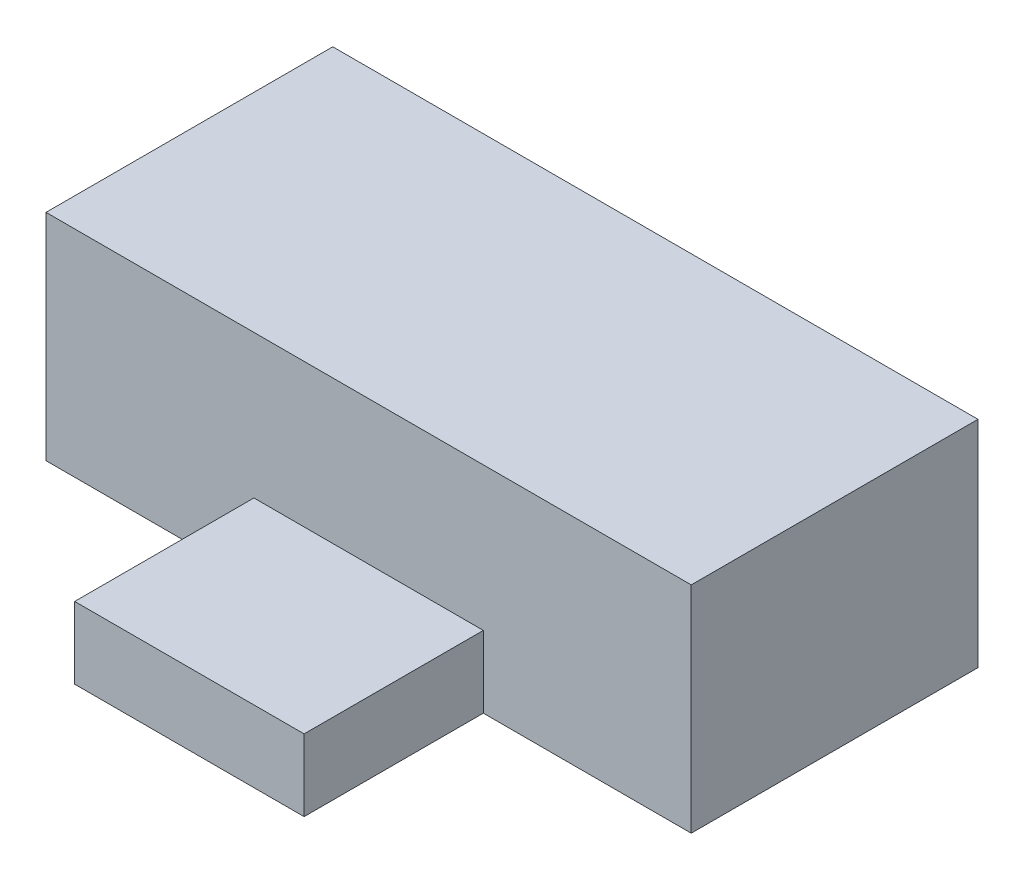
ISO-10303-21;
HEADER;
FILE_DESCRIPTION(('STEP AP214'),'2;1');
FILE_NAME('part.step','',(''),(''),'','','');
FILE_SCHEMA(('AUTOMOTIVE_DESIGN { 1 0 10303 214 1 1 1 1 }'));
ENDSEC;
DATA;
#1=APPLICATION_CONTEXT('core data for automotive mechanical design processes');
#2=APPLICATION_PROTOCOL_DEFINITION('international standard','automotive_design',2000,#1);
#3=PRODUCT_CONTEXT('',#1,'mechanical');
#4=PRODUCT('Part','Part','',(#3));
#5=PRODUCT_RELATED_PRODUCT_CATEGORY('part','',(#4));
#6=PRODUCT_DEFINITION_FORMATION('','',#4);
#7=PRODUCT_DEFINITION_CONTEXT('part definition',#1,'design');
#8=PRODUCT_DEFINITION('design','',#6,#7);
#9=PRODUCT_DEFINITION_SHAPE('','',#8);
#10=(LENGTH_UNIT() NAMED_UNIT(*) SI_UNIT(.MILLI.,.METRE.));
#11=(NAMED_UNIT(*) PLANE_ANGLE_UNIT() SI_UNIT($,.RADIAN.));
#12=(NAMED_UNIT(*) SI_UNIT($,.STERADIAN.) SOLID_ANGLE_UNIT());
#13=UNCERTAINTY_MEASURE_WITH_UNIT(LENGTH_MEASURE(1.E-05),#10,'distance_accuracy_value','');
#14=(GEOMETRIC_REPRESENTATION_CONTEXT(3) GLOBAL_UNCERTAINTY_ASSIGNED_CONTEXT((#13)) GLOBAL_UNIT_ASSIGNED_CONTEXT((#10,
#11,#12)) REPRESENTATION_CONTEXT('',''));
#15=CARTESIAN_POINT('',(0.,0.,0.));
#16=DIRECTION('',(0.,0.,1.));
#17=DIRECTION('',(1.,0.,0.));
#18=AXIS2_PLACEMENT_3D('',#15,#16,#17);
#19=CARTESIAN_POINT('',(-9.,6.,4.));
#20=DIRECTION('',(0.,0.,-1.));
#21=DIRECTION('',(-1.,0.,0.));
#22=AXIS2_PLACEMENT_3D('',#19,#20,#21);
#23=PLANE('',#22);
#24=DIRECTION('',(0.,1.,0.));
#25=VECTOR('',#24,1.);
#26=CARTESIAN_POINT('',(3.2,2.,4.));
#27=LINE('',#26,#25);
#28=CARTESIAN_POINT('',(3.2,0.,4.));
#29=VERTEX_POINT('',#28);
#30=CARTESIAN_POINT('',(3.2,2.,4.));
#31=VERTEX_POINT('',#30);
#32=EDGE_CURVE('E57',#29,#31,#27,.T.);
#33=ORIENTED_EDGE('',*,*,#32,.F.);
#34=DIRECTION('',(1.,0.,0.));
#35=VECTOR('',#34,1.);
#36=CARTESIAN_POINT('',(-9.,0.,4.));
#37=LINE('',#36,#35);
#38=CARTESIAN_POINT('',(9.,0.,4.));
#39=VERTEX_POINT('',#38);
#40=EDGE_CURVE('E145',#29,#39,#37,.T.);
#41=ORIENTED_EDGE('',*,*,#40,.T.);
#42=DIRECTION('',(0.,-1.,0.));
#43=VECTOR('',#42,1.);
#44=CARTESIAN_POINT('',(9.,6.,4.));
#45=LINE('',#44,#43);
#46=CARTESIAN_POINT('',(9.,6.,4.));
#47=VERTEX_POINT('',#46);
#48=EDGE_CURVE('E140',#47,#39,#45,.T.);
#49=ORIENTED_EDGE('',*,*,#48,.F.);
#50=DIRECTION('',(1.,0.,0.));
#51=VECTOR('',#50,1.);
#52=CARTESIAN_POINT('',(-9.,6.,4.));
#53=LINE('',#52,#51);
#54=CARTESIAN_POINT('',(-9.,6.,4.));
#55=VERTEX_POINT('',#54);
#56=EDGE_CURVE('E139',#55,#47,#53,.T.);
#57=ORIENTED_EDGE('',*,*,#56,.F.);
#58=DIRECTION('',(0.,-1.,0.));
#59=VECTOR('',#58,1.);
#60=CARTESIAN_POINT('',(-9.,6.,4.));
#61=LINE('',#60,#59);
#62=CARTESIAN_POINT('',(-9.,0.,4.));
#63=VERTEX_POINT('',#62);
#64=EDGE_CURVE('E155',#55,#63,#61,.T.);
#65=ORIENTED_EDGE('',*,*,#64,.T.);
#66=CARTESIAN_POINT('',(-3.2,0.,4.));
#67=VERTEX_POINT('',#66);
#68=EDGE_CURVE('E135',#63,#67,#37,.T.);
#69=ORIENTED_EDGE('',*,*,#68,.T.);
#70=DIRECTION('',(0.,-1.,0.));
#71=VECTOR('',#70,1.);
#72=CARTESIAN_POINT('',(-3.2,2.,4.));
#73=LINE('',#72,#71);
#74=CARTESIAN_POINT('',(-3.2,2.,4.));
#75=VERTEX_POINT('',#74);
#76=EDGE_CURVE('E119',#75,#67,#73,.T.);
#77=ORIENTED_EDGE('',*,*,#76,.F.);
#78=DIRECTION('',(-1.,0.,0.));
#79=VECTOR('',#78,1.);
#80=CARTESIAN_POINT('',(-3.2,2.,4.));
#81=LINE('',#80,#79);
#82=EDGE_CURVE('E52',#31,#75,#81,.T.);
#83=ORIENTED_EDGE('',*,*,#82,.F.);
#84=EDGE_LOOP('',(#33,#41,#49,#57,#65,#69,#77,#83));
#85=FACE_BOUND('',#84,.T.);
#86=ADVANCED_FACE('F35',(#85),#23,.F.);
#87=CARTESIAN_POINT('',(9.,6.,-4.));
#88=DIRECTION('',(-1.,0.,0.));
#89=DIRECTION('',(0.,0.,1.));
#90=AXIS2_PLACEMENT_3D('',#87,#88,#89);
#91=PLANE('',#90);
#92=DIRECTION('',(0.,0.,-1.));
#93=VECTOR('',#92,1.);
#94=CARTESIAN_POINT('',(9.,0.,-4.));
#95=LINE('',#94,#93);
#96=CARTESIAN_POINT('',(9.,0.,-4.));
#97=VERTEX_POINT('',#96);
#98=EDGE_CURVE('E122',#39,#97,#95,.T.);
#99=ORIENTED_EDGE('',*,*,#98,.T.);
#100=DIRECTION('',(0.,-1.,0.));
#101=VECTOR('',#100,1.);
#102=CARTESIAN_POINT('',(9.,6.,-4.));
#103=LINE('',#102,#101);
#104=CARTESIAN_POINT('',(9.,6.,-4.));
#105=VERTEX_POINT('',#104);
#106=EDGE_CURVE('E11',#105,#97,#103,.T.);
#107=ORIENTED_EDGE('',*,*,#106,.F.);
#108=DIRECTION('',(0.,0.,-1.));
#109=VECTOR('',#108,1.);
#110=CARTESIAN_POINT('',(9.,6.,-4.));
#111=LINE('',#110,#109);
#112=EDGE_CURVE('E131',#47,#105,#111,.T.);
#113=ORIENTED_EDGE('',*,*,#112,.F.);
#114=ORIENTED_EDGE('',*,*,#48,.T.);
#115=EDGE_LOOP('',(#99,#107,#113,#114));
#116=FACE_BOUND('',#115,.T.);
#117=ADVANCED_FACE('F37',(#116),#91,.F.);
#118=CARTESIAN_POINT('',(-9.,6.,-4.));
#119=DIRECTION('',(0.,0.,1.));
#120=DIRECTION('',(1.,0.,0.));
#121=AXIS2_PLACEMENT_3D('',#118,#119,#120);
#122=PLANE('',#121);
#123=DIRECTION('',(-1.,0.,0.));
#124=VECTOR('',#123,1.);
#125=CARTESIAN_POINT('',(-9.,0.,-4.));
#126=LINE('',#125,#124);
#127=CARTESIAN_POINT('',(-9.,0.,-4.));
#128=VERTEX_POINT('',#127);
#129=EDGE_CURVE('E125',#97,#128,#126,.T.);
#130=ORIENTED_EDGE('',*,*,#129,.T.);
#131=DIRECTION('',(0.,-1.,0.));
#132=VECTOR('',#131,1.);
#133=CARTESIAN_POINT('',(-9.,6.,-4.));
#134=LINE('',#133,#132);
#135=CARTESIAN_POINT('',(-9.,6.,-4.));
#136=VERTEX_POINT('',#135);
#137=EDGE_CURVE('E44',#136,#128,#134,.T.);
#138=ORIENTED_EDGE('',*,*,#137,.F.);
#139=DIRECTION('',(-1.,0.,0.));
#140=VECTOR('',#139,1.);
#141=CARTESIAN_POINT('',(-9.,6.,-4.));
#142=LINE('',#141,#140);
#143=EDGE_CURVE('E134',#105,#136,#142,.T.);
#144=ORIENTED_EDGE('',*,*,#143,.F.);
#145=ORIENTED_EDGE('',*,*,#106,.T.);
#146=EDGE_LOOP('',(#130,#138,#144,#145));
#147=FACE_BOUND('',#146,.T.);
#148=ADVANCED_FACE('F171',(#147),#122,.F.);
#149=CARTESIAN_POINT('',(-9.,6.,-4.));
#150=DIRECTION('',(1.,0.,0.));
#151=DIRECTION('',(0.,0.,-1.));
#152=AXIS2_PLACEMENT_3D('',#149,#150,#151);
#153=PLANE('',#152);
#154=DIRECTION('',(0.,0.,1.));
#155=VECTOR('',#154,1.);
#156=CARTESIAN_POINT('',(-9.,0.,-4.));
#157=LINE('',#156,#155);
#158=EDGE_CURVE('E143',#128,#63,#157,.T.);
#159=ORIENTED_EDGE('',*,*,#158,.T.);
#160=ORIENTED_EDGE('',*,*,#64,.F.);
#161=DIRECTION('',(0.,0.,1.));
#162=VECTOR('',#161,1.);
#163=CARTESIAN_POINT('',(-9.,6.,-4.));
#164=LINE('',#163,#162);
#165=EDGE_CURVE('E137',#136,#55,#164,.T.);
#166=ORIENTED_EDGE('',*,*,#165,.F.);
#167=ORIENTED_EDGE('',*,*,#137,.T.);
#168=EDGE_LOOP('',(#159,#160,#166,#167));
#169=FACE_BOUND('',#168,.T.);
#170=ADVANCED_FACE('F183',(#169),#153,.F.);
#171=CARTESIAN_POINT('',(0.,6.,0.));
#172=DIRECTION('',(0.,1.,0.));
#173=DIRECTION('',(0.,0.,1.));
#174=AXIS2_PLACEMENT_3D('',#171,#172,#173);
#175=PLANE('',#174);
#176=ORIENTED_EDGE('',*,*,#112,.T.);
#177=ORIENTED_EDGE('',*,*,#143,.T.);
#178=ORIENTED_EDGE('',*,*,#165,.T.);
#179=ORIENTED_EDGE('',*,*,#56,.T.);
#180=EDGE_LOOP('',(#176,#177,#178,#179));
#181=FACE_BOUND('',#180,.T.);
#182=ADVANCED_FACE('F174',(#181),#175,.T.);
#183=CARTESIAN_POINT('',(0.,0.,0.));
#184=DIRECTION('',(0.,1.,0.));
#185=DIRECTION('',(0.,0.,1.));
#186=AXIS2_PLACEMENT_3D('',#183,#184,#185);
#187=PLANE('',#186);
#188=ORIENTED_EDGE('',*,*,#98,.F.);
#189=ORIENTED_EDGE('',*,*,#40,.F.);
#190=DIRECTION('',(0.,0.,-1.));
#191=VECTOR('',#190,1.);
#192=CARTESIAN_POINT('',(3.2,0.,9.));
#193=LINE('',#192,#191);
#194=CARTESIAN_POINT('',(3.2,0.,9.));
#195=VERTEX_POINT('',#194);
#196=EDGE_CURVE('E266',#195,#29,#193,.T.);
#197=ORIENTED_EDGE('',*,*,#196,.F.);
#198=DIRECTION('',(1.,0.,0.));
#199=VECTOR('',#198,1.);
#200=CARTESIAN_POINT('',(-3.2,0.,9.));
#201=LINE('',#200,#199);
#202=CARTESIAN_POINT('',(-3.2,0.,9.));
#203=VERTEX_POINT('',#202);
#204=EDGE_CURVE('E115',#203,#195,#201,.T.);
#205=ORIENTED_EDGE('',*,*,#204,.F.);
#206=DIRECTION('',(0.,0.,-1.));
#207=VECTOR('',#206,1.);
#208=CARTESIAN_POINT('',(-3.2,0.,9.));
#209=LINE('',#208,#207);
#210=EDGE_CURVE('E127',#203,#67,#209,.T.);
#211=ORIENTED_EDGE('',*,*,#210,.T.);
#212=ORIENTED_EDGE('',*,*,#68,.F.);
#213=ORIENTED_EDGE('',*,*,#158,.F.);
#214=ORIENTED_EDGE('',*,*,#129,.F.);
#215=EDGE_LOOP('',(#188,#189,#197,#205,#211,#212,#213,#214));
#216=FACE_BOUND('',#215,.T.);
#217=ADVANCED_FACE('F167',(#216),#187,.F.);
#218=CARTESIAN_POINT('',(3.2,2.,9.));
#219=DIRECTION('',(-1.,0.,0.));
#220=DIRECTION('',(0.,-1.,0.));
#221=AXIS2_PLACEMENT_3D('',#218,#219,#220);
#222=PLANE('',#221);
#223=ORIENTED_EDGE('',*,*,#32,.T.);
#224=DIRECTION('',(0.,0.,-1.));
#225=VECTOR('',#224,1.);
#226=CARTESIAN_POINT('',(3.2,2.,9.));
#227=LINE('',#226,#225);
#228=CARTESIAN_POINT('',(3.2,2.,9.));
#229=VERTEX_POINT('',#228);
#230=EDGE_CURVE('E104',#229,#31,#227,.T.);
#231=ORIENTED_EDGE('',*,*,#230,.F.);
#232=DIRECTION('',(0.,1.,0.));
#233=VECTOR('',#232,1.);
#234=CARTESIAN_POINT('',(3.2,2.,9.));
#235=LINE('',#234,#233);
#236=EDGE_CURVE('E110',#195,#229,#235,.T.);
#237=ORIENTED_EDGE('',*,*,#236,.F.);
#238=ORIENTED_EDGE('',*,*,#196,.T.);
#239=EDGE_LOOP('',(#223,#231,#237,#238));
#240=FACE_BOUND('',#239,.T.);
#241=ADVANCED_FACE('F121',(#240),#222,.F.);
#242=CARTESIAN_POINT('',(-3.2,2.,9.));
#243=DIRECTION('',(0.,-1.,0.));
#244=DIRECTION('',(0.,0.,-1.));
#245=AXIS2_PLACEMENT_3D('',#242,#243,#244);
#246=PLANE('',#245);
#247=ORIENTED_EDGE('',*,*,#82,.T.);
#248=DIRECTION('',(0.,0.,-1.));
#249=VECTOR('',#248,1.);
#250=CARTESIAN_POINT('',(-3.2,2.,9.));
#251=LINE('',#250,#249);
#252=CARTESIAN_POINT('',(-3.2,2.,9.));
#253=VERTEX_POINT('',#252);
#254=EDGE_CURVE('E106',#253,#75,#251,.T.);
#255=ORIENTED_EDGE('',*,*,#254,.F.);
#256=DIRECTION('',(-1.,0.,0.));
#257=VECTOR('',#256,1.);
#258=CARTESIAN_POINT('',(-3.2,2.,9.));
#259=LINE('',#258,#257);
#260=EDGE_CURVE('E100',#229,#253,#259,.T.);
#261=ORIENTED_EDGE('',*,*,#260,.F.);
#262=ORIENTED_EDGE('',*,*,#230,.T.);
#263=EDGE_LOOP('',(#247,#255,#261,#262));
#264=FACE_BOUND('',#263,.T.);
#265=ADVANCED_FACE('F102',(#264),#246,.F.);
#266=CARTESIAN_POINT('',(-3.2,2.,9.));
#267=DIRECTION('',(1.,0.,0.));
#268=DIRECTION('',(0.,1.,0.));
#269=AXIS2_PLACEMENT_3D('',#266,#267,#268);
#270=PLANE('',#269);
#271=ORIENTED_EDGE('',*,*,#76,.T.);
#272=ORIENTED_EDGE('',*,*,#210,.F.);
#273=DIRECTION('',(0.,-1.,0.));
#274=VECTOR('',#273,1.);
#275=CARTESIAN_POINT('',(-3.2,2.,9.));
#276=LINE('',#275,#274);
#277=EDGE_CURVE('E109',#253,#203,#276,.T.);
#278=ORIENTED_EDGE('',*,*,#277,.F.);
#279=ORIENTED_EDGE('',*,*,#254,.T.);
#280=EDGE_LOOP('',(#271,#272,#278,#279));
#281=FACE_BOUND('',#280,.T.);
#282=ADVANCED_FACE('F217',(#281),#270,.F.);
#283=CARTESIAN_POINT('',(0.,0.,9.));
#284=DIRECTION('',(0.,0.,1.));
#285=DIRECTION('',(1.,0.,0.));
#286=AXIS2_PLACEMENT_3D('',#283,#284,#285);
#287=PLANE('',#286);
#288=ORIENTED_EDGE('',*,*,#236,.T.);
#289=ORIENTED_EDGE('',*,*,#260,.T.);
#290=ORIENTED_EDGE('',*,*,#277,.T.);
#291=ORIENTED_EDGE('',*,*,#204,.T.);
#292=EDGE_LOOP('',(#288,#289,#290,#291));
#293=FACE_BOUND('',#292,.T.);
#294=ADVANCED_FACE('F113',(#293),#287,.T.);
#295=CLOSED_SHELL('',(#86,#117,#148,#170,#182,#217,#241,#265,#282,#294));
#296=MANIFOLD_SOLID_BREP('B2',#295);
#297=ADVANCED_BREP_SHAPE_REPRESENTATION('',(#18,#296),#14);
#298=SHAPE_DEFINITION_REPRESENTATION(#9,#297);
ENDSEC;
END-ISO-10303-21;
